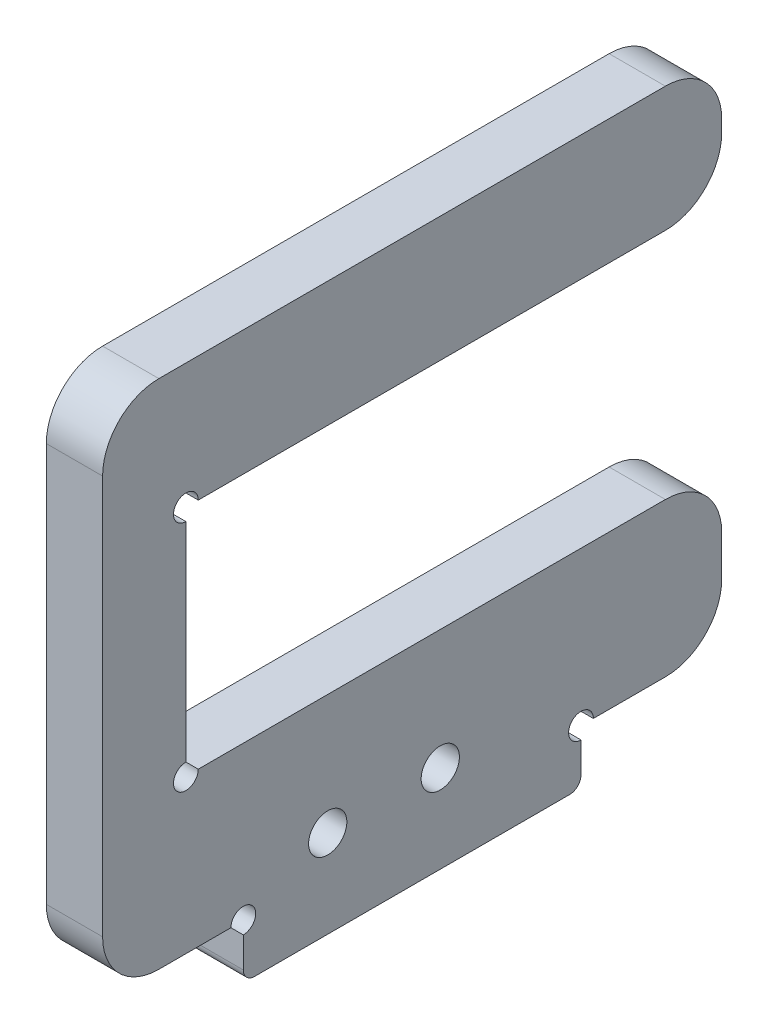
ISO-10303-21;
HEADER;
FILE_DESCRIPTION(('STEP AP214'),'2;1');
FILE_NAME('part.step','',(''),(''),'','','');
FILE_SCHEMA(('AUTOMOTIVE_DESIGN { 1 0 10303 214 1 1 1 1 }'));
ENDSEC;
DATA;
#1=APPLICATION_CONTEXT('core data for automotive mechanical design processes');
#2=APPLICATION_PROTOCOL_DEFINITION('international standard','automotive_design',2000,#1);
#3=PRODUCT_CONTEXT('',#1,'mechanical');
#4=PRODUCT('Part','Part','',(#3));
#5=PRODUCT_RELATED_PRODUCT_CATEGORY('part','',(#4));
#6=PRODUCT_DEFINITION_FORMATION('','',#4);
#7=PRODUCT_DEFINITION_CONTEXT('part definition',#1,'design');
#8=PRODUCT_DEFINITION('design','',#6,#7);
#9=PRODUCT_DEFINITION_SHAPE('','',#8);
#10=(LENGTH_UNIT() NAMED_UNIT(*) SI_UNIT(.MILLI.,.METRE.));
#11=(NAMED_UNIT(*) PLANE_ANGLE_UNIT() SI_UNIT($,.RADIAN.));
#12=(NAMED_UNIT(*) SI_UNIT($,.STERADIAN.) SOLID_ANGLE_UNIT());
#13=UNCERTAINTY_MEASURE_WITH_UNIT(LENGTH_MEASURE(1.E-05),#10,'distance_accuracy_value','');
#14=(GEOMETRIC_REPRESENTATION_CONTEXT(3) GLOBAL_UNCERTAINTY_ASSIGNED_CONTEXT((#13)) GLOBAL_UNIT_ASSIGNED_CONTEXT((#10,
#11,#12)) REPRESENTATION_CONTEXT('',''));
#15=CARTESIAN_POINT('',(0.,0.,0.));
#16=DIRECTION('',(0.,0.,1.));
#17=DIRECTION('',(1.,0.,0.));
#18=AXIS2_PLACEMENT_3D('',#15,#16,#17);
#19=CARTESIAN_POINT('',(5.,0.,-55.));
#20=DIRECTION('',(0.,0.,1.));
#21=DIRECTION('',(1.,0.,0.));
#22=AXIS2_PLACEMENT_3D('',#19,#20,#21);
#23=PLANE('',#22);
#24=DIRECTION('',(0.,1.,0.));
#25=VECTOR('',#24,1.);
#26=CARTESIAN_POINT('',(0.,0.,-55.));
#27=LINE('',#26,#25);
#28=CARTESIAN_POINT('',(0.,5.,-55.));
#29=VERTEX_POINT('',#28);
#30=CARTESIAN_POINT('',(0.,8.65,-55.));
#31=VERTEX_POINT('',#30);
#32=EDGE_CURVE('E306',#29,#31,#27,.T.);
#33=ORIENTED_EDGE('',*,*,#32,.T.);
#34=DIRECTION('',(-1.,0.,0.));
#35=VECTOR('',#34,1.);
#36=CARTESIAN_POINT('',(5.,8.65,-55.));
#37=LINE('',#36,#35);
#38=CARTESIAN_POINT('',(5.,8.65,-55.));
#39=VERTEX_POINT('',#38);
#40=EDGE_CURVE('E11',#31,#39,#37,.F.);
#41=ORIENTED_EDGE('',*,*,#40,.T.);
#42=DIRECTION('',(0.,1.,0.));
#43=VECTOR('',#42,1.);
#44=CARTESIAN_POINT('',(5.,0.,-55.));
#45=LINE('',#44,#43);
#46=CARTESIAN_POINT('',(5.,5.,-55.));
#47=VERTEX_POINT('',#46);
#48=EDGE_CURVE('E298',#47,#39,#45,.T.);
#49=ORIENTED_EDGE('',*,*,#48,.F.);
#50=DIRECTION('',(-1.,0.,0.));
#51=VECTOR('',#50,1.);
#52=CARTESIAN_POINT('',(5.,5.,-55.));
#53=LINE('',#52,#51);
#54=EDGE_CURVE('E346',#47,#29,#53,.T.);
#55=ORIENTED_EDGE('',*,*,#54,.T.);
#56=EDGE_LOOP('',(#33,#41,#49,#55));
#57=FACE_BOUND('',#56,.T.);
#58=ADVANCED_FACE('F43',(#57),#23,.F.);
#59=CARTESIAN_POINT('',(5.,0.,0.));
#60=DIRECTION('',(0.,1.,0.));
#61=DIRECTION('',(0.,0.,1.));
#62=AXIS2_PLACEMENT_3D('',#59,#60,#61);
#63=PLANE('',#62);
#64=DIRECTION('',(0.,0.,-1.));
#65=VECTOR('',#64,1.);
#66=CARTESIAN_POINT('',(5.,0.,0.));
#67=LINE('',#66,#65);
#68=CARTESIAN_POINT('',(5.,0.,-5.));
#69=VERTEX_POINT('',#68);
#70=CARTESIAN_POINT('',(5.,0.,-11.4));
#71=VERTEX_POINT('',#70);
#72=EDGE_CURVE('E295',#69,#71,#67,.T.);
#73=ORIENTED_EDGE('',*,*,#72,.F.);
#74=DIRECTION('',(-1.,0.,0.));
#75=VECTOR('',#74,1.);
#76=CARTESIAN_POINT('',(5.,0.,-5.));
#77=LINE('',#76,#75);
#78=CARTESIAN_POINT('',(0.,0.,-5.));
#79=VERTEX_POINT('',#78);
#80=EDGE_CURVE('E212',#69,#79,#77,.T.);
#81=ORIENTED_EDGE('',*,*,#80,.T.);
#82=DIRECTION('',(0.,0.,-1.));
#83=VECTOR('',#82,1.);
#84=CARTESIAN_POINT('',(0.,0.,0.));
#85=LINE('',#84,#83);
#86=CARTESIAN_POINT('',(0.,0.,-11.4));
#87=VERTEX_POINT('',#86);
#88=EDGE_CURVE('E206',#79,#87,#85,.T.);
#89=ORIENTED_EDGE('',*,*,#88,.T.);
#90=DIRECTION('',(-1.,0.,0.));
#91=VECTOR('',#90,1.);
#92=CARTESIAN_POINT('',(5.,0.,-11.4));
#93=LINE('',#92,#91);
#94=EDGE_CURVE('E210',#87,#71,#93,.F.);
#95=ORIENTED_EDGE('',*,*,#94,.T.);
#96=EDGE_LOOP('',(#73,#81,#89,#95));
#97=FACE_BOUND('',#96,.T.);
#98=ADVANCED_FACE('F209',(#97),#63,.F.);
#99=CARTESIAN_POINT('',(5.,0.,0.));
#100=DIRECTION('',(-1.,0.,0.));
#101=DIRECTION('',(0.,0.,1.));
#102=AXIS2_PLACEMENT_3D('',#99,#100,#101);
#103=PLANE('',#102);
#104=CARTESIAN_POINT('',(5.,3.,-30.));
#105=DIRECTION('',(-1.,0.,0.));
#106=DIRECTION('',(0.,0.,1.));
#107=AXIS2_PLACEMENT_3D('',#104,#105,#106);
#108=CIRCLE('',#107,1.7);
#109=CARTESIAN_POINT('',(5.,3.,-28.3));
#110=VERTEX_POINT('',#109);
#111=EDGE_CURVE('E532',#110,#110,#108,.T.);
#112=ORIENTED_EDGE('',*,*,#111,.T.);
#113=EDGE_LOOP('',(#112));
#114=FACE_BOUND('',#113,.T.);
#115=CARTESIAN_POINT('',(5.,3.,-20.));
#116=DIRECTION('',(-1.,0.,0.));
#117=DIRECTION('',(0.,0.,1.));
#118=AXIS2_PLACEMENT_3D('',#115,#116,#117);
#119=CIRCLE('',#118,1.7);
#120=CARTESIAN_POINT('',(5.,3.,-18.3));
#121=VERTEX_POINT('',#120);
#122=EDGE_CURVE('E251',#121,#121,#119,.T.);
#123=ORIENTED_EDGE('',*,*,#122,.T.);
#124=EDGE_LOOP('',(#123));
#125=FACE_BOUND('',#124,.T.);
#126=DIRECTION('',(0.,0.,1.));
#127=VECTOR('',#126,1.);
#128=CARTESIAN_POINT('',(5.,34.35,-7.4));
#129=LINE('',#128,#127);
#130=CARTESIAN_POINT('',(5.,34.35,-50.));
#131=VERTEX_POINT('',#130);
#132=CARTESIAN_POINT('',(5.,34.35,-8.49999999999999));
#133=VERTEX_POINT('',#132);
#134=EDGE_CURVE('E281',#131,#133,#129,.T.);
#135=ORIENTED_EDGE('',*,*,#134,.F.);
#136=CARTESIAN_POINT('',(5.,39.35,-50.));
#137=DIRECTION('',(-1.,0.,0.));
#138=DIRECTION('',(0.,0.,1.));
#139=AXIS2_PLACEMENT_3D('',#136,#137,#138);
#140=CIRCLE('',#139,5.);
#141=CARTESIAN_POINT('',(5.,39.35,-55.));
#142=VERTEX_POINT('',#141);
#143=EDGE_CURVE('E382',#131,#142,#140,.F.);
#144=ORIENTED_EDGE('',*,*,#143,.T.);
#145=CARTESIAN_POINT('',(5.,40.45,-55.));
#146=VERTEX_POINT('',#145);
#147=EDGE_CURVE('E297',#142,#146,#45,.T.);
#148=ORIENTED_EDGE('',*,*,#147,.T.);
#149=CARTESIAN_POINT('',(5.,40.45,-50.));
#150=DIRECTION('',(-1.,0.,0.));
#151=DIRECTION('',(0.,0.,1.));
#152=AXIS2_PLACEMENT_3D('',#149,#150,#151);
#153=CIRCLE('',#152,5.);
#154=CARTESIAN_POINT('',(5.,45.45,-50.));
#155=VERTEX_POINT('',#154);
#156=EDGE_CURVE('E335',#146,#155,#153,.F.);
#157=ORIENTED_EDGE('',*,*,#156,.T.);
#158=DIRECTION('',(0.,0.,1.));
#159=VECTOR('',#158,1.);
#160=CARTESIAN_POINT('',(5.,45.45,0.));
#161=LINE('',#160,#159);
#162=CARTESIAN_POINT('',(5.,45.45,-5.));
#163=VERTEX_POINT('',#162);
#164=EDGE_CURVE('E300',#155,#163,#161,.T.);
#165=ORIENTED_EDGE('',*,*,#164,.T.);
#166=CARTESIAN_POINT('',(5.,40.45,-5.));
#167=DIRECTION('',(-1.,0.,0.));
#168=DIRECTION('',(0.,0.,1.));
#169=AXIS2_PLACEMENT_3D('',#166,#167,#168);
#170=CIRCLE('',#169,5.);
#171=CARTESIAN_POINT('',(5.,40.45,0.));
#172=VERTEX_POINT('',#171);
#173=EDGE_CURVE('E337',#163,#172,#170,.F.);
#174=ORIENTED_EDGE('',*,*,#173,.T.);
#175=DIRECTION('',(0.,-1.,0.));
#176=VECTOR('',#175,1.);
#177=CARTESIAN_POINT('',(5.,0.,0.));
#178=LINE('',#177,#176);
#179=CARTESIAN_POINT('',(5.,5.,0.));
#180=VERTEX_POINT('',#179);
#181=EDGE_CURVE('E290',#172,#180,#178,.T.);
#182=ORIENTED_EDGE('',*,*,#181,.T.);
#183=CARTESIAN_POINT('',(5.,5.,-5.));
#184=DIRECTION('',(-1.,0.,0.));
#185=DIRECTION('',(0.,0.,1.));
#186=AXIS2_PLACEMENT_3D('',#183,#184,#185);
#187=CIRCLE('',#186,5.);
#188=EDGE_CURVE('E339',#180,#69,#187,.F.);
#189=ORIENTED_EDGE('',*,*,#188,.T.);
#190=ORIENTED_EDGE('',*,*,#72,.T.);
#191=CARTESIAN_POINT('',(5.,0.,-12.5));
#192=DIRECTION('',(-1.,0.,0.));
#193=DIRECTION('',(0.,0.,1.));
#194=AXIS2_PLACEMENT_3D('',#191,#192,#193);
#195=CIRCLE('',#194,1.1);
#196=CARTESIAN_POINT('',(5.,-1.1,-12.5));
#197=VERTEX_POINT('',#196);
#198=EDGE_CURVE('E226',#71,#197,#195,.T.);
#199=ORIENTED_EDGE('',*,*,#198,.T.);
#200=DIRECTION('',(0.,1.,0.));
#201=VECTOR('',#200,1.);
#202=CARTESIAN_POINT('',(5.,0.,-12.5));
#203=LINE('',#202,#201);
#204=CARTESIAN_POINT('',(5.,-3.8,-12.5));
#205=VERTEX_POINT('',#204);
#206=EDGE_CURVE('E266',#205,#197,#203,.T.);
#207=ORIENTED_EDGE('',*,*,#206,.F.);
#208=CARTESIAN_POINT('',(5.,-3.8,-13.5));
#209=DIRECTION('',(-1.,0.,0.));
#210=DIRECTION('',(0.,0.,1.));
#211=AXIS2_PLACEMENT_3D('',#208,#209,#210);
#212=CIRCLE('',#211,1.);
#213=CARTESIAN_POINT('',(5.,-4.8,-13.5));
#214=VERTEX_POINT('',#213);
#215=EDGE_CURVE('E367',#205,#214,#212,.F.);
#216=ORIENTED_EDGE('',*,*,#215,.T.);
#217=DIRECTION('',(0.,0.,1.));
#218=VECTOR('',#217,1.);
#219=CARTESIAN_POINT('',(5.,-4.8,-42.5));
#220=LINE('',#219,#218);
#221=CARTESIAN_POINT('',(5.,-4.8,-41.5));
#222=VERTEX_POINT('',#221);
#223=EDGE_CURVE('E263',#222,#214,#220,.T.);
#224=ORIENTED_EDGE('',*,*,#223,.F.);
#225=CARTESIAN_POINT('',(5.,-3.8,-41.5));
#226=DIRECTION('',(-1.,0.,0.));
#227=DIRECTION('',(0.,0.,1.));
#228=AXIS2_PLACEMENT_3D('',#225,#226,#227);
#229=CIRCLE('',#228,1.);
#230=CARTESIAN_POINT('',(5.,-3.8,-42.5));
#231=VERTEX_POINT('',#230);
#232=EDGE_CURVE('E365',#222,#231,#229,.F.);
#233=ORIENTED_EDGE('',*,*,#232,.T.);
#234=DIRECTION('',(0.,-1.,0.));
#235=VECTOR('',#234,1.);
#236=CARTESIAN_POINT('',(5.,0.,-42.5));
#237=LINE('',#236,#235);
#238=CARTESIAN_POINT('',(5.,-1.1,-42.5));
#239=VERTEX_POINT('',#238);
#240=EDGE_CURVE('E260',#239,#231,#237,.T.);
#241=ORIENTED_EDGE('',*,*,#240,.F.);
#242=CARTESIAN_POINT('',(5.,0.,-42.5));
#243=DIRECTION('',(-1.,0.,0.));
#244=DIRECTION('',(0.,0.,1.));
#245=AXIS2_PLACEMENT_3D('',#242,#243,#244);
#246=CIRCLE('',#245,1.1);
#247=CARTESIAN_POINT('',(5.,0.,-43.6));
#248=VERTEX_POINT('',#247);
#249=EDGE_CURVE('E228',#239,#248,#246,.T.);
#250=ORIENTED_EDGE('',*,*,#249,.T.);
#251=CARTESIAN_POINT('',(5.,0.,-50.));
#252=VERTEX_POINT('',#251);
#253=EDGE_CURVE('E293',#248,#252,#67,.T.);
#254=ORIENTED_EDGE('',*,*,#253,.T.);
#255=CARTESIAN_POINT('',(5.,5.,-50.));
#256=DIRECTION('',(-1.,0.,0.));
#257=DIRECTION('',(0.,0.,1.));
#258=AXIS2_PLACEMENT_3D('',#255,#256,#257);
#259=CIRCLE('',#258,5.);
#260=EDGE_CURVE('E333',#252,#47,#259,.F.);
#261=ORIENTED_EDGE('',*,*,#260,.T.);
#262=ORIENTED_EDGE('',*,*,#48,.T.);
#263=CARTESIAN_POINT('',(5.,8.65,-50.));
#264=DIRECTION('',(-1.,0.,0.));
#265=DIRECTION('',(0.,0.,1.));
#266=AXIS2_PLACEMENT_3D('',#263,#264,#265);
#267=CIRCLE('',#266,5.);
#268=CARTESIAN_POINT('',(5.,13.65,-50.));
#269=VERTEX_POINT('',#268);
#270=EDGE_CURVE('E58',#39,#269,#267,.F.);
#271=ORIENTED_EDGE('',*,*,#270,.T.);
#272=DIRECTION('',(0.,0.,-1.));
#273=VECTOR('',#272,1.);
#274=CARTESIAN_POINT('',(5.,13.65,-7.4));
#275=LINE('',#274,#273);
#276=CARTESIAN_POINT('',(5.,13.65,-8.5));
#277=VERTEX_POINT('',#276);
#278=EDGE_CURVE('E278',#277,#269,#275,.T.);
#279=ORIENTED_EDGE('',*,*,#278,.F.);
#280=CARTESIAN_POINT('',(5.,13.65,-7.4));
#281=DIRECTION('',(-1.,0.,0.));
#282=DIRECTION('',(0.,0.,1.));
#283=AXIS2_PLACEMENT_3D('',#280,#281,#282);
#284=CIRCLE('',#283,1.1);
#285=CARTESIAN_POINT('',(5.,14.75,-7.4));
#286=VERTEX_POINT('',#285);
#287=EDGE_CURVE('E243',#277,#286,#284,.T.);
#288=ORIENTED_EDGE('',*,*,#287,.T.);
#289=DIRECTION('',(0.,-1.,0.));
#290=VECTOR('',#289,1.);
#291=CARTESIAN_POINT('',(5.,34.35,-7.4));
#292=LINE('',#291,#290);
#293=CARTESIAN_POINT('',(5.,33.25,-7.4));
#294=VERTEX_POINT('',#293);
#295=EDGE_CURVE('E275',#294,#286,#292,.T.);
#296=ORIENTED_EDGE('',*,*,#295,.F.);
#297=CARTESIAN_POINT('',(5.,34.35,-7.4));
#298=DIRECTION('',(-1.,0.,0.));
#299=DIRECTION('',(0.,0.,1.));
#300=AXIS2_PLACEMENT_3D('',#297,#298,#299);
#301=CIRCLE('',#300,1.1);
#302=EDGE_CURVE('E249',#294,#133,#301,.T.);
#303=ORIENTED_EDGE('',*,*,#302,.T.);
#304=EDGE_LOOP('',(#135,#144,#148,#157,#165,#174,#182,#189,#190,#199,#207,#216,#224,#233,#241,
#250,#254,#261,#262,#271,#279,#288,#296,#303));
#305=FACE_BOUND('',#304,.T.);
#306=ADVANCED_FACE('F402',(#114,#125,#305),#103,.F.);
#307=CARTESIAN_POINT('',(0.,0.,0.));
#308=DIRECTION('',(-1.,0.,0.));
#309=DIRECTION('',(0.,0.,1.));
#310=AXIS2_PLACEMENT_3D('',#307,#308,#309);
#311=PLANE('',#310);
#312=CARTESIAN_POINT('',(0.,39.35,-55.));
#313=VERTEX_POINT('',#312);
#314=CARTESIAN_POINT('',(0.,40.45,-55.));
#315=VERTEX_POINT('',#314);
#316=EDGE_CURVE('E215',#313,#315,#27,.T.);
#317=ORIENTED_EDGE('',*,*,#316,.F.);
#318=CARTESIAN_POINT('',(0.,39.35,-50.));
#319=DIRECTION('',(-1.,0.,0.));
#320=DIRECTION('',(0.,0.,1.));
#321=AXIS2_PLACEMENT_3D('',#318,#319,#320);
#322=CIRCLE('',#321,5.);
#323=CARTESIAN_POINT('',(0.,34.35,-50.));
#324=VERTEX_POINT('',#323);
#325=EDGE_CURVE('E377',#313,#324,#322,.T.);
#326=ORIENTED_EDGE('',*,*,#325,.T.);
#327=DIRECTION('',(0.,0.,1.));
#328=VECTOR('',#327,1.);
#329=CARTESIAN_POINT('',(0.,34.35,-7.4));
#330=LINE('',#329,#328);
#331=CARTESIAN_POINT('',(0.,34.35,-8.49999999999999));
#332=VERTEX_POINT('',#331);
#333=EDGE_CURVE('E279',#324,#332,#330,.T.);
#334=ORIENTED_EDGE('',*,*,#333,.T.);
#335=CARTESIAN_POINT('',(0.,34.35,-7.4));
#336=DIRECTION('',(-1.,0.,0.));
#337=DIRECTION('',(0.,0.,1.));
#338=AXIS2_PLACEMENT_3D('',#335,#336,#337);
#339=CIRCLE('',#338,1.1);
#340=CARTESIAN_POINT('',(0.,33.25,-7.4));
#341=VERTEX_POINT('',#340);
#342=EDGE_CURVE('E246',#341,#332,#339,.T.);
#343=ORIENTED_EDGE('',*,*,#342,.F.);
#344=DIRECTION('',(0.,-1.,0.));
#345=VECTOR('',#344,1.);
#346=CARTESIAN_POINT('',(0.,34.35,-7.4));
#347=LINE('',#346,#345);
#348=CARTESIAN_POINT('',(0.,14.75,-7.4));
#349=VERTEX_POINT('',#348);
#350=EDGE_CURVE('E268',#341,#349,#347,.T.);
#351=ORIENTED_EDGE('',*,*,#350,.T.);
#352=CARTESIAN_POINT('',(0.,13.65,-7.4));
#353=DIRECTION('',(-1.,0.,0.));
#354=DIRECTION('',(0.,0.,1.));
#355=AXIS2_PLACEMENT_3D('',#352,#353,#354);
#356=CIRCLE('',#355,1.1);
#357=CARTESIAN_POINT('',(0.,13.65,-8.5));
#358=VERTEX_POINT('',#357);
#359=EDGE_CURVE('E238',#358,#349,#356,.T.);
#360=ORIENTED_EDGE('',*,*,#359,.F.);
#361=DIRECTION('',(0.,0.,-1.));
#362=VECTOR('',#361,1.);
#363=CARTESIAN_POINT('',(0.,13.65,-7.4));
#364=LINE('',#363,#362);
#365=CARTESIAN_POINT('',(0.,13.65,-50.));
#366=VERTEX_POINT('',#365);
#367=EDGE_CURVE('E286',#358,#366,#364,.T.);
#368=ORIENTED_EDGE('',*,*,#367,.T.);
#369=CARTESIAN_POINT('',(0.,8.65,-50.));
#370=DIRECTION('',(-1.,0.,0.));
#371=DIRECTION('',(0.,0.,1.));
#372=AXIS2_PLACEMENT_3D('',#369,#370,#371);
#373=CIRCLE('',#372,5.);
#374=EDGE_CURVE('E375',#366,#31,#373,.T.);
#375=ORIENTED_EDGE('',*,*,#374,.T.);
#376=ORIENTED_EDGE('',*,*,#32,.F.);
#377=CARTESIAN_POINT('',(0.,5.,-50.));
#378=DIRECTION('',(-1.,0.,0.));
#379=DIRECTION('',(0.,0.,1.));
#380=AXIS2_PLACEMENT_3D('',#377,#378,#379);
#381=CIRCLE('',#380,5.);
#382=CARTESIAN_POINT('',(0.,0.,-50.));
#383=VERTEX_POINT('',#382);
#384=EDGE_CURVE('E319',#29,#383,#381,.T.);
#385=ORIENTED_EDGE('',*,*,#384,.T.);
#386=CARTESIAN_POINT('',(0.,0.,-43.6));
#387=VERTEX_POINT('',#386);
#388=EDGE_CURVE('E216',#387,#383,#85,.T.);
#389=ORIENTED_EDGE('',*,*,#388,.F.);
#390=CARTESIAN_POINT('',(0.,0.,-42.5));
#391=DIRECTION('',(-1.,0.,0.));
#392=DIRECTION('',(0.,0.,1.));
#393=AXIS2_PLACEMENT_3D('',#390,#391,#392);
#394=CIRCLE('',#393,1.1);
#395=CARTESIAN_POINT('',(0.,-1.1,-42.5));
#396=VERTEX_POINT('',#395);
#397=EDGE_CURVE('E235',#396,#387,#394,.T.);
#398=ORIENTED_EDGE('',*,*,#397,.F.);
#399=DIRECTION('',(0.,-1.,0.));
#400=VECTOR('',#399,1.);
#401=CARTESIAN_POINT('',(0.,0.,-42.5));
#402=LINE('',#401,#400);
#403=CARTESIAN_POINT('',(0.,-3.8,-42.5));
#404=VERTEX_POINT('',#403);
#405=EDGE_CURVE('E259',#396,#404,#402,.T.);
#406=ORIENTED_EDGE('',*,*,#405,.T.);
#407=CARTESIAN_POINT('',(0.,-3.8,-41.5));
#408=DIRECTION('',(-1.,0.,0.));
#409=DIRECTION('',(0.,0.,1.));
#410=AXIS2_PLACEMENT_3D('',#407,#408,#409);
#411=CIRCLE('',#410,1.);
#412=CARTESIAN_POINT('',(0.,-4.8,-41.5));
#413=VERTEX_POINT('',#412);
#414=EDGE_CURVE('E359',#404,#413,#411,.T.);
#415=ORIENTED_EDGE('',*,*,#414,.T.);
#416=DIRECTION('',(0.,0.,1.));
#417=VECTOR('',#416,1.);
#418=CARTESIAN_POINT('',(0.,-4.8,-42.5));
#419=LINE('',#418,#417);
#420=CARTESIAN_POINT('',(0.,-4.8,-13.5));
#421=VERTEX_POINT('',#420);
#422=EDGE_CURVE('E271',#413,#421,#419,.T.);
#423=ORIENTED_EDGE('',*,*,#422,.T.);
#424=CARTESIAN_POINT('',(0.,-3.8,-13.5));
#425=DIRECTION('',(-1.,0.,0.));
#426=DIRECTION('',(0.,0.,1.));
#427=AXIS2_PLACEMENT_3D('',#424,#425,#426);
#428=CIRCLE('',#427,1.);
#429=CARTESIAN_POINT('',(0.,-3.8,-12.5));
#430=VERTEX_POINT('',#429);
#431=EDGE_CURVE('E361',#421,#430,#428,.T.);
#432=ORIENTED_EDGE('',*,*,#431,.T.);
#433=DIRECTION('',(0.,1.,0.));
#434=VECTOR('',#433,1.);
#435=CARTESIAN_POINT('',(0.,0.,-12.5));
#436=LINE('',#435,#434);
#437=CARTESIAN_POINT('',(0.,-1.1,-12.5));
#438=VERTEX_POINT('',#437);
#439=EDGE_CURVE('E234',#430,#438,#436,.T.);
#440=ORIENTED_EDGE('',*,*,#439,.T.);
#441=CARTESIAN_POINT('',(0.,0.,-12.5));
#442=DIRECTION('',(-1.,0.,0.));
#443=DIRECTION('',(0.,0.,1.));
#444=AXIS2_PLACEMENT_3D('',#441,#442,#443);
#445=CIRCLE('',#444,1.1);
#446=EDGE_CURVE('E223',#87,#438,#445,.T.);
#447=ORIENTED_EDGE('',*,*,#446,.F.);
#448=ORIENTED_EDGE('',*,*,#88,.F.);
#449=CARTESIAN_POINT('',(0.,5.,-5.));
#450=DIRECTION('',(-1.,0.,0.));
#451=DIRECTION('',(0.,0.,1.));
#452=AXIS2_PLACEMENT_3D('',#449,#450,#451);
#453=CIRCLE('',#452,5.);
#454=CARTESIAN_POINT('',(0.,5.,0.));
#455=VERTEX_POINT('',#454);
#456=EDGE_CURVE('E326',#79,#455,#453,.T.);
#457=ORIENTED_EDGE('',*,*,#456,.T.);
#458=DIRECTION('',(0.,-1.,0.));
#459=VECTOR('',#458,1.);
#460=CARTESIAN_POINT('',(0.,0.,0.));
#461=LINE('',#460,#459);
#462=CARTESIAN_POINT('',(0.,40.45,0.));
#463=VERTEX_POINT('',#462);
#464=EDGE_CURVE('E283',#463,#455,#461,.T.);
#465=ORIENTED_EDGE('',*,*,#464,.F.);
#466=CARTESIAN_POINT('',(0.,40.45,-5.));
#467=DIRECTION('',(-1.,0.,0.));
#468=DIRECTION('',(0.,0.,1.));
#469=AXIS2_PLACEMENT_3D('',#466,#467,#468);
#470=CIRCLE('',#469,5.);
#471=CARTESIAN_POINT('',(0.,45.45,-5.));
#472=VERTEX_POINT('',#471);
#473=EDGE_CURVE('E324',#463,#472,#470,.T.);
#474=ORIENTED_EDGE('',*,*,#473,.T.);
#475=DIRECTION('',(0.,0.,1.));
#476=VECTOR('',#475,1.);
#477=CARTESIAN_POINT('',(0.,45.45,0.));
#478=LINE('',#477,#476);
#479=CARTESIAN_POINT('',(0.,45.45,-50.));
#480=VERTEX_POINT('',#479);
#481=EDGE_CURVE('E294',#480,#472,#478,.T.);
#482=ORIENTED_EDGE('',*,*,#481,.F.);
#483=CARTESIAN_POINT('',(0.,40.45,-50.));
#484=DIRECTION('',(-1.,0.,0.));
#485=DIRECTION('',(0.,0.,1.));
#486=AXIS2_PLACEMENT_3D('',#483,#484,#485);
#487=CIRCLE('',#486,5.);
#488=EDGE_CURVE('E321',#480,#315,#487,.T.);
#489=ORIENTED_EDGE('',*,*,#488,.T.);
#490=EDGE_LOOP('',(#317,#326,#334,#343,#351,#360,#368,#375,#376,#385,#389,#398,#406,#415,#423,
#432,#440,#447,#448,#457,#465,#474,#482,#489));
#491=FACE_BOUND('',#490,.T.);
#492=CARTESIAN_POINT('',(0.,3.,-30.));
#493=DIRECTION('',(-1.,0.,0.));
#494=DIRECTION('',(0.,0.,1.));
#495=AXIS2_PLACEMENT_3D('',#492,#493,#494);
#496=CIRCLE('',#495,1.7);
#497=CARTESIAN_POINT('',(0.,3.,-28.3));
#498=VERTEX_POINT('',#497);
#499=EDGE_CURVE('E535',#498,#498,#496,.T.);
#500=ORIENTED_EDGE('',*,*,#499,.F.);
#501=EDGE_LOOP('',(#500));
#502=FACE_BOUND('',#501,.T.);
#503=CARTESIAN_POINT('',(0.,3.,-20.));
#504=DIRECTION('',(-1.,0.,0.));
#505=DIRECTION('',(0.,0.,1.));
#506=AXIS2_PLACEMENT_3D('',#503,#504,#505);
#507=CIRCLE('',#506,1.7);
#508=CARTESIAN_POINT('',(0.,3.,-18.3));
#509=VERTEX_POINT('',#508);
#510=EDGE_CURVE('E537',#509,#509,#507,.T.);
#511=ORIENTED_EDGE('',*,*,#510,.F.);
#512=EDGE_LOOP('',(#511));
#513=FACE_BOUND('',#512,.T.);
#514=ADVANCED_FACE('F231',(#491,#502,#513),#311,.T.);
#515=CARTESIAN_POINT('',(5.,0.,0.));
#516=DIRECTION('',(0.,0.,-1.));
#517=DIRECTION('',(-1.,0.,0.));
#518=AXIS2_PLACEMENT_3D('',#515,#516,#517);
#519=PLANE('',#518);
#520=ORIENTED_EDGE('',*,*,#464,.T.);
#521=DIRECTION('',(-1.,0.,0.));
#522=VECTOR('',#521,1.);
#523=CARTESIAN_POINT('',(5.,5.,0.));
#524=LINE('',#523,#522);
#525=EDGE_CURVE('E331',#455,#180,#524,.F.);
#526=ORIENTED_EDGE('',*,*,#525,.T.);
#527=ORIENTED_EDGE('',*,*,#181,.F.);
#528=DIRECTION('',(-1.,0.,0.));
#529=VECTOR('',#528,1.);
#530=CARTESIAN_POINT('',(5.,40.45,0.));
#531=LINE('',#530,#529);
#532=EDGE_CURVE('E328',#172,#463,#531,.T.);
#533=ORIENTED_EDGE('',*,*,#532,.T.);
#534=EDGE_LOOP('',(#520,#526,#527,#533));
#535=FACE_BOUND('',#534,.T.);
#536=ADVANCED_FACE('F434',(#535),#519,.F.);
#537=ORIENTED_EDGE('',*,*,#388,.T.);
#538=DIRECTION('',(-1.,0.,0.));
#539=VECTOR('',#538,1.);
#540=CARTESIAN_POINT('',(5.,0.,-50.));
#541=LINE('',#540,#539);
#542=EDGE_CURVE('E352',#383,#252,#541,.F.);
#543=ORIENTED_EDGE('',*,*,#542,.T.);
#544=ORIENTED_EDGE('',*,*,#253,.F.);
#545=DIRECTION('',(-1.,0.,0.));
#546=VECTOR('',#545,1.);
#547=CARTESIAN_POINT('',(5.,0.,-43.6));
#548=LINE('',#547,#546);
#549=EDGE_CURVE('E227',#248,#387,#548,.T.);
#550=ORIENTED_EDGE('',*,*,#549,.T.);
#551=EDGE_LOOP('',(#537,#543,#544,#550));
#552=FACE_BOUND('',#551,.T.);
#553=ADVANCED_FACE('F468',(#552),#63,.F.);
#554=ORIENTED_EDGE('',*,*,#147,.F.);
#555=DIRECTION('',(-1.,0.,0.));
#556=VECTOR('',#555,1.);
#557=CARTESIAN_POINT('',(0.,39.35,-55.));
#558=LINE('',#557,#556);
#559=EDGE_CURVE('E372',#142,#313,#558,.T.);
#560=ORIENTED_EDGE('',*,*,#559,.T.);
#561=ORIENTED_EDGE('',*,*,#316,.T.);
#562=DIRECTION('',(-1.,0.,0.));
#563=VECTOR('',#562,1.);
#564=CARTESIAN_POINT('',(5.,40.45,-55.));
#565=LINE('',#564,#563);
#566=EDGE_CURVE('E349',#315,#146,#565,.F.);
#567=ORIENTED_EDGE('',*,*,#566,.T.);
#568=EDGE_LOOP('',(#554,#560,#561,#567));
#569=FACE_BOUND('',#568,.T.);
#570=ADVANCED_FACE('F416',(#569),#23,.F.);
#571=CARTESIAN_POINT('',(5.,45.45,0.));
#572=DIRECTION('',(0.,-1.,0.));
#573=DIRECTION('',(0.,0.,-1.));
#574=AXIS2_PLACEMENT_3D('',#571,#572,#573);
#575=PLANE('',#574);
#576=ORIENTED_EDGE('',*,*,#481,.T.);
#577=DIRECTION('',(-1.,0.,0.));
#578=VECTOR('',#577,1.);
#579=CARTESIAN_POINT('',(5.,45.45,-5.));
#580=LINE('',#579,#578);
#581=EDGE_CURVE('E344',#472,#163,#580,.F.);
#582=ORIENTED_EDGE('',*,*,#581,.T.);
#583=ORIENTED_EDGE('',*,*,#164,.F.);
#584=DIRECTION('',(-1.,0.,0.));
#585=VECTOR('',#584,1.);
#586=CARTESIAN_POINT('',(5.,45.45,-50.));
#587=LINE('',#586,#585);
#588=EDGE_CURVE('E341',#155,#480,#587,.T.);
#589=ORIENTED_EDGE('',*,*,#588,.T.);
#590=EDGE_LOOP('',(#576,#582,#583,#589));
#591=FACE_BOUND('',#590,.T.);
#592=ADVANCED_FACE('F425',(#591),#575,.F.);
#593=CARTESIAN_POINT('',(5.,34.35,-7.4));
#594=DIRECTION('',(0.,0.,-1.));
#595=DIRECTION('',(-1.,0.,0.));
#596=AXIS2_PLACEMENT_3D('',#593,#594,#595);
#597=PLANE('',#596);
#598=DIRECTION('',(-1.,0.,0.));
#599=VECTOR('',#598,1.);
#600=CARTESIAN_POINT('',(5.,14.75,-7.4));
#601=LINE('',#600,#599);
#602=EDGE_CURVE('E257',#349,#286,#601,.F.);
#603=ORIENTED_EDGE('',*,*,#602,.F.);
#604=ORIENTED_EDGE('',*,*,#350,.F.);
#605=DIRECTION('',(-1.,0.,0.));
#606=VECTOR('',#605,1.);
#607=CARTESIAN_POINT('',(5.,33.25,-7.4));
#608=LINE('',#607,#606);
#609=EDGE_CURVE('E255',#294,#341,#608,.T.);
#610=ORIENTED_EDGE('',*,*,#609,.F.);
#611=ORIENTED_EDGE('',*,*,#295,.T.);
#612=EDGE_LOOP('',(#603,#604,#610,#611));
#613=FACE_BOUND('',#612,.T.);
#614=ADVANCED_FACE('F398',(#613),#597,.T.);
#615=CARTESIAN_POINT('',(5.,13.65,-7.4));
#616=DIRECTION('',(0.,1.,0.));
#617=DIRECTION('',(0.,0.,1.));
#618=AXIS2_PLACEMENT_3D('',#615,#616,#617);
#619=PLANE('',#618);
#620=ORIENTED_EDGE('',*,*,#278,.T.);
#621=DIRECTION('',(-1.,0.,0.));
#622=VECTOR('',#621,1.);
#623=CARTESIAN_POINT('',(0.,13.65,-50.));
#624=LINE('',#623,#622);
#625=EDGE_CURVE('E51',#269,#366,#624,.T.);
#626=ORIENTED_EDGE('',*,*,#625,.T.);
#627=ORIENTED_EDGE('',*,*,#367,.F.);
#628=DIRECTION('',(-1.,0.,0.));
#629=VECTOR('',#628,1.);
#630=CARTESIAN_POINT('',(5.,13.65,-8.5));
#631=LINE('',#630,#629);
#632=EDGE_CURVE('E316',#277,#358,#631,.T.);
#633=ORIENTED_EDGE('',*,*,#632,.F.);
#634=EDGE_LOOP('',(#620,#626,#627,#633));
#635=FACE_BOUND('',#634,.T.);
#636=ADVANCED_FACE('F387',(#635),#619,.T.);
#637=CARTESIAN_POINT('',(5.,34.35,-7.4));
#638=DIRECTION('',(0.,-1.,0.));
#639=DIRECTION('',(0.,0.,-1.));
#640=AXIS2_PLACEMENT_3D('',#637,#638,#639);
#641=PLANE('',#640);
#642=ORIENTED_EDGE('',*,*,#333,.F.);
#643=DIRECTION('',(-1.,0.,0.));
#644=VECTOR('',#643,1.);
#645=CARTESIAN_POINT('',(5.,34.35,-50.));
#646=LINE('',#645,#644);
#647=EDGE_CURVE('E379',#324,#131,#646,.F.);
#648=ORIENTED_EDGE('',*,*,#647,.T.);
#649=ORIENTED_EDGE('',*,*,#134,.T.);
#650=DIRECTION('',(-1.,0.,0.));
#651=VECTOR('',#650,1.);
#652=CARTESIAN_POINT('',(5.,34.35,-8.49999999999999));
#653=LINE('',#652,#651);
#654=EDGE_CURVE('E313',#332,#133,#653,.F.);
#655=ORIENTED_EDGE('',*,*,#654,.F.);
#656=EDGE_LOOP('',(#642,#648,#649,#655));
#657=FACE_BOUND('',#656,.T.);
#658=ADVANCED_FACE('F409',(#657),#641,.T.);
#659=CARTESIAN_POINT('',(5.,0.,-42.5));
#660=DIRECTION('',(0.,0.,-1.));
#661=DIRECTION('',(0.,1.,0.));
#662=AXIS2_PLACEMENT_3D('',#659,#660,#661);
#663=PLANE('',#662);
#664=ORIENTED_EDGE('',*,*,#240,.T.);
#665=DIRECTION('',(-1.,0.,0.));
#666=VECTOR('',#665,1.);
#667=CARTESIAN_POINT('',(5.,-3.8,-42.5));
#668=LINE('',#667,#666);
#669=EDGE_CURVE('E369',#231,#404,#668,.T.);
#670=ORIENTED_EDGE('',*,*,#669,.T.);
#671=ORIENTED_EDGE('',*,*,#405,.F.);
#672=DIRECTION('',(-1.,0.,0.));
#673=VECTOR('',#672,1.);
#674=CARTESIAN_POINT('',(5.,-1.1,-42.5));
#675=LINE('',#674,#673);
#676=EDGE_CURVE('E311',#239,#396,#675,.T.);
#677=ORIENTED_EDGE('',*,*,#676,.F.);
#678=EDGE_LOOP('',(#664,#670,#671,#677));
#679=FACE_BOUND('',#678,.T.);
#680=ADVANCED_FACE('F458',(#679),#663,.T.);
#681=CARTESIAN_POINT('',(5.,0.,-12.5));
#682=DIRECTION('',(0.,0.,1.));
#683=DIRECTION('',(1.,0.,0.));
#684=AXIS2_PLACEMENT_3D('',#681,#682,#683);
#685=PLANE('',#684);
#686=ORIENTED_EDGE('',*,*,#439,.F.);
#687=DIRECTION('',(-1.,0.,0.));
#688=VECTOR('',#687,1.);
#689=CARTESIAN_POINT('',(5.,-3.8,-12.5));
#690=LINE('',#689,#688);
#691=EDGE_CURVE('E363',#430,#205,#690,.F.);
#692=ORIENTED_EDGE('',*,*,#691,.T.);
#693=ORIENTED_EDGE('',*,*,#206,.T.);
#694=DIRECTION('',(-1.,0.,0.));
#695=VECTOR('',#694,1.);
#696=CARTESIAN_POINT('',(5.,-1.1,-12.5));
#697=LINE('',#696,#695);
#698=EDGE_CURVE('E303',#438,#197,#697,.F.);
#699=ORIENTED_EDGE('',*,*,#698,.F.);
#700=EDGE_LOOP('',(#686,#692,#693,#699));
#701=FACE_BOUND('',#700,.T.);
#702=ADVANCED_FACE('F560',(#701),#685,.T.);
#703=CARTESIAN_POINT('',(5.,-4.8,-42.5));
#704=DIRECTION('',(0.,-1.,0.));
#705=DIRECTION('',(0.,0.,-1.));
#706=AXIS2_PLACEMENT_3D('',#703,#704,#705);
#707=PLANE('',#706);
#708=ORIENTED_EDGE('',*,*,#223,.T.);
#709=DIRECTION('',(-1.,0.,0.));
#710=VECTOR('',#709,1.);
#711=CARTESIAN_POINT('',(5.,-4.8,-13.5));
#712=LINE('',#711,#710);
#713=EDGE_CURVE('E356',#214,#421,#712,.T.);
#714=ORIENTED_EDGE('',*,*,#713,.T.);
#715=ORIENTED_EDGE('',*,*,#422,.F.);
#716=DIRECTION('',(-1.,0.,0.));
#717=VECTOR('',#716,1.);
#718=CARTESIAN_POINT('',(5.,-4.8,-41.5));
#719=LINE('',#718,#717);
#720=EDGE_CURVE('E354',#413,#222,#719,.F.);
#721=ORIENTED_EDGE('',*,*,#720,.T.);
#722=EDGE_LOOP('',(#708,#714,#715,#721));
#723=FACE_BOUND('',#722,.T.);
#724=ADVANCED_FACE('F449',(#723),#707,.T.);
#725=CARTESIAN_POINT('',(5.,0.,-12.5));
#726=DIRECTION('',(-1.,0.,0.));
#727=DIRECTION('',(0.,0.,1.));
#728=AXIS2_PLACEMENT_3D('',#725,#726,#727);
#729=CYLINDRICAL_SURFACE('',#728,1.1);
#730=ORIENTED_EDGE('',*,*,#446,.T.);
#731=ORIENTED_EDGE('',*,*,#698,.T.);
#732=ORIENTED_EDGE('',*,*,#198,.F.);
#733=ORIENTED_EDGE('',*,*,#94,.F.);
#734=EDGE_LOOP('',(#730,#731,#732,#733));
#735=FACE_BOUND('',#734,.T.);
#736=ADVANCED_FACE('F221',(#735),#729,.F.);
#737=CARTESIAN_POINT('',(5.,0.,-42.5));
#738=DIRECTION('',(-1.,0.,0.));
#739=DIRECTION('',(0.,0.,1.));
#740=AXIS2_PLACEMENT_3D('',#737,#738,#739);
#741=CYLINDRICAL_SURFACE('',#740,1.1);
#742=ORIENTED_EDGE('',*,*,#249,.F.);
#743=ORIENTED_EDGE('',*,*,#676,.T.);
#744=ORIENTED_EDGE('',*,*,#397,.T.);
#745=ORIENTED_EDGE('',*,*,#549,.F.);
#746=EDGE_LOOP('',(#742,#743,#744,#745));
#747=FACE_BOUND('',#746,.T.);
#748=ADVANCED_FACE('F474',(#747),#741,.F.);
#749=CARTESIAN_POINT('',(5.,34.35,-7.4));
#750=DIRECTION('',(-1.,0.,0.));
#751=DIRECTION('',(0.,0.,1.));
#752=AXIS2_PLACEMENT_3D('',#749,#750,#751);
#753=CYLINDRICAL_SURFACE('',#752,1.1);
#754=ORIENTED_EDGE('',*,*,#609,.T.);
#755=ORIENTED_EDGE('',*,*,#342,.T.);
#756=ORIENTED_EDGE('',*,*,#654,.T.);
#757=ORIENTED_EDGE('',*,*,#302,.F.);
#758=EDGE_LOOP('',(#754,#755,#756,#757));
#759=FACE_BOUND('',#758,.T.);
#760=ADVANCED_FACE('F405',(#759),#753,.F.);
#761=CARTESIAN_POINT('',(5.,13.65,-7.4));
#762=DIRECTION('',(-1.,0.,0.));
#763=DIRECTION('',(0.,0.,1.));
#764=AXIS2_PLACEMENT_3D('',#761,#762,#763);
#765=CYLINDRICAL_SURFACE('',#764,1.1);
#766=ORIENTED_EDGE('',*,*,#602,.T.);
#767=ORIENTED_EDGE('',*,*,#287,.F.);
#768=ORIENTED_EDGE('',*,*,#632,.T.);
#769=ORIENTED_EDGE('',*,*,#359,.T.);
#770=EDGE_LOOP('',(#766,#767,#768,#769));
#771=FACE_BOUND('',#770,.T.);
#772=ADVANCED_FACE('F396',(#771),#765,.F.);
#773=CARTESIAN_POINT('',(5.,5.,-5.));
#774=DIRECTION('',(-1.,0.,0.));
#775=DIRECTION('',(0.,0.,1.));
#776=AXIS2_PLACEMENT_3D('',#773,#774,#775);
#777=CYLINDRICAL_SURFACE('',#776,5.);
#778=ORIENTED_EDGE('',*,*,#188,.F.);
#779=ORIENTED_EDGE('',*,*,#525,.F.);
#780=ORIENTED_EDGE('',*,*,#456,.F.);
#781=ORIENTED_EDGE('',*,*,#80,.F.);
#782=EDGE_LOOP('',(#778,#779,#780,#781));
#783=FACE_BOUND('',#782,.T.);
#784=ADVANCED_FACE('F438',(#783),#777,.T.);
#785=CARTESIAN_POINT('',(5.,40.45,-5.));
#786=DIRECTION('',(-1.,0.,0.));
#787=DIRECTION('',(0.,0.,1.));
#788=AXIS2_PLACEMENT_3D('',#785,#786,#787);
#789=CYLINDRICAL_SURFACE('',#788,5.);
#790=ORIENTED_EDGE('',*,*,#173,.F.);
#791=ORIENTED_EDGE('',*,*,#581,.F.);
#792=ORIENTED_EDGE('',*,*,#473,.F.);
#793=ORIENTED_EDGE('',*,*,#532,.F.);
#794=EDGE_LOOP('',(#790,#791,#792,#793));
#795=FACE_BOUND('',#794,.T.);
#796=ADVANCED_FACE('F429',(#795),#789,.T.);
#797=CARTESIAN_POINT('',(5.,40.45,-50.));
#798=DIRECTION('',(-1.,0.,0.));
#799=DIRECTION('',(0.,0.,1.));
#800=AXIS2_PLACEMENT_3D('',#797,#798,#799);
#801=CYLINDRICAL_SURFACE('',#800,5.);
#802=ORIENTED_EDGE('',*,*,#156,.F.);
#803=ORIENTED_EDGE('',*,*,#566,.F.);
#804=ORIENTED_EDGE('',*,*,#488,.F.);
#805=ORIENTED_EDGE('',*,*,#588,.F.);
#806=EDGE_LOOP('',(#802,#803,#804,#805));
#807=FACE_BOUND('',#806,.T.);
#808=ADVANCED_FACE('F421',(#807),#801,.T.);
#809=CARTESIAN_POINT('',(5.,5.,-50.));
#810=DIRECTION('',(-1.,0.,0.));
#811=DIRECTION('',(0.,0.,1.));
#812=AXIS2_PLACEMENT_3D('',#809,#810,#811);
#813=CYLINDRICAL_SURFACE('',#812,5.);
#814=ORIENTED_EDGE('',*,*,#260,.F.);
#815=ORIENTED_EDGE('',*,*,#542,.F.);
#816=ORIENTED_EDGE('',*,*,#384,.F.);
#817=ORIENTED_EDGE('',*,*,#54,.F.);
#818=EDGE_LOOP('',(#814,#815,#816,#817));
#819=FACE_BOUND('',#818,.T.);
#820=ADVANCED_FACE('F472',(#819),#813,.T.);
#821=CARTESIAN_POINT('',(5.,-3.8,-13.5));
#822=DIRECTION('',(-1.,0.,0.));
#823=DIRECTION('',(0.,0.,1.));
#824=AXIS2_PLACEMENT_3D('',#821,#822,#823);
#825=CYLINDRICAL_SURFACE('',#824,1.);
#826=ORIENTED_EDGE('',*,*,#215,.F.);
#827=ORIENTED_EDGE('',*,*,#691,.F.);
#828=ORIENTED_EDGE('',*,*,#431,.F.);
#829=ORIENTED_EDGE('',*,*,#713,.F.);
#830=EDGE_LOOP('',(#826,#827,#828,#829));
#831=FACE_BOUND('',#830,.T.);
#832=ADVANCED_FACE('F446',(#831),#825,.T.);
#833=CARTESIAN_POINT('',(5.,-3.8,-41.5));
#834=DIRECTION('',(-1.,0.,0.));
#835=DIRECTION('',(0.,0.,1.));
#836=AXIS2_PLACEMENT_3D('',#833,#834,#835);
#837=CYLINDRICAL_SURFACE('',#836,1.);
#838=ORIENTED_EDGE('',*,*,#232,.F.);
#839=ORIENTED_EDGE('',*,*,#720,.F.);
#840=ORIENTED_EDGE('',*,*,#414,.F.);
#841=ORIENTED_EDGE('',*,*,#669,.F.);
#842=EDGE_LOOP('',(#838,#839,#840,#841));
#843=FACE_BOUND('',#842,.T.);
#844=ADVANCED_FACE('F456',(#843),#837,.T.);
#845=CARTESIAN_POINT('',(0.,3.,-20.));
#846=DIRECTION('',(-1.,0.,0.));
#847=DIRECTION('',(0.,0.,1.));
#848=AXIS2_PLACEMENT_3D('',#845,#846,#847);
#849=CYLINDRICAL_SURFACE('',#848,1.7);
#850=ORIENTED_EDGE('',*,*,#122,.F.);
#851=EDGE_LOOP('',(#850));
#852=FACE_BOUND('',#851,.T.);
#853=ORIENTED_EDGE('',*,*,#510,.T.);
#854=EDGE_LOOP('',(#853));
#855=FACE_BOUND('',#854,.T.);
#856=ADVANCED_FACE('F516',(#852,#855),#849,.F.);
#857=CARTESIAN_POINT('',(0.,3.,-30.));
#858=DIRECTION('',(-1.,0.,0.));
#859=DIRECTION('',(0.,0.,1.));
#860=AXIS2_PLACEMENT_3D('',#857,#858,#859);
#861=CYLINDRICAL_SURFACE('',#860,1.7);
#862=ORIENTED_EDGE('',*,*,#111,.F.);
#863=EDGE_LOOP('',(#862));
#864=FACE_BOUND('',#863,.T.);
#865=ORIENTED_EDGE('',*,*,#499,.T.);
#866=EDGE_LOOP('',(#865));
#867=FACE_BOUND('',#866,.T.);
#868=ADVANCED_FACE('F518',(#864,#867),#861,.F.);
#869=CARTESIAN_POINT('',(5.,39.35,-50.));
#870=DIRECTION('',(1.,0.,0.));
#871=DIRECTION('',(0.,0.,-1.));
#872=AXIS2_PLACEMENT_3D('',#869,#870,#871);
#873=CYLINDRICAL_SURFACE('',#872,5.);
#874=ORIENTED_EDGE('',*,*,#143,.F.);
#875=ORIENTED_EDGE('',*,*,#647,.F.);
#876=ORIENTED_EDGE('',*,*,#325,.F.);
#877=ORIENTED_EDGE('',*,*,#559,.F.);
#878=EDGE_LOOP('',(#874,#875,#876,#877));
#879=FACE_BOUND('',#878,.T.);
#880=ADVANCED_FACE('F412',(#879),#873,.T.);
#881=CARTESIAN_POINT('',(5.,8.65,-50.));
#882=DIRECTION('',(1.,0.,0.));
#883=DIRECTION('',(0.,0.,-1.));
#884=AXIS2_PLACEMENT_3D('',#881,#882,#883);
#885=CYLINDRICAL_SURFACE('',#884,5.);
#886=ORIENTED_EDGE('',*,*,#270,.F.);
#887=ORIENTED_EDGE('',*,*,#40,.F.);
#888=ORIENTED_EDGE('',*,*,#374,.F.);
#889=ORIENTED_EDGE('',*,*,#625,.F.);
#890=EDGE_LOOP('',(#886,#887,#888,#889));
#891=FACE_BOUND('',#890,.T.);
#892=ADVANCED_FACE('F45',(#891),#885,.T.);
#893=CLOSED_SHELL('',(#58,#98,#306,#514,#536,#553,#570,#592,#614,#636,#658,#680,#702,#724,#736,
#748,#760,#772,#784,#796,#808,#820,#832,#844,#856,#868,#880,#892));
#894=MANIFOLD_SOLID_BREP('B2',#893);
#895=ADVANCED_BREP_SHAPE_REPRESENTATION('',(#18,#894),#14);
#896=SHAPE_DEFINITION_REPRESENTATION(#9,#895);
ENDSEC;
END-ISO-10303-21;
